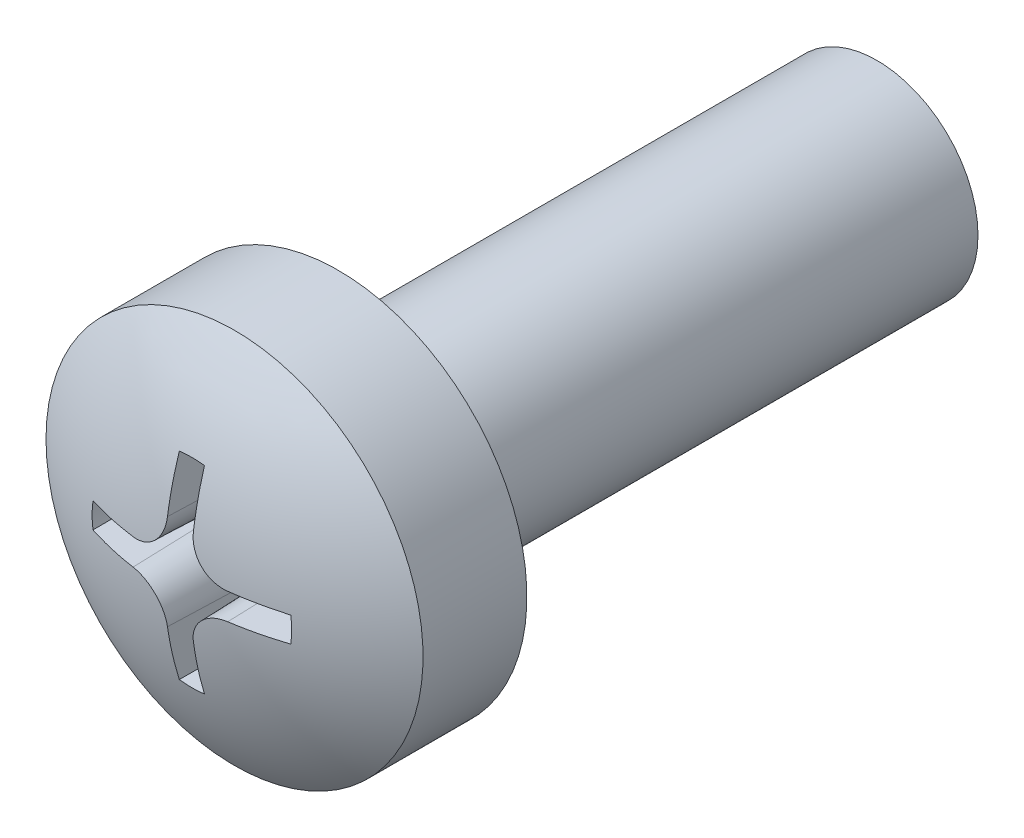
ISO-10303-21;
HEADER;
FILE_DESCRIPTION(('STEP AP214'),'2;1');
FILE_NAME('part.step','',(''),(''),'','','');
FILE_SCHEMA(('AUTOMOTIVE_DESIGN { 1 0 10303 214 1 1 1 1 }'));
ENDSEC;
DATA;
#1=APPLICATION_CONTEXT('core data for automotive mechanical design processes');
#2=APPLICATION_PROTOCOL_DEFINITION('international standard','automotive_design',2000,#1);
#3=PRODUCT_CONTEXT('',#1,'mechanical');
#4=PRODUCT('Part','Part','',(#3));
#5=PRODUCT_RELATED_PRODUCT_CATEGORY('part','',(#4));
#6=PRODUCT_DEFINITION_FORMATION('','',#4);
#7=PRODUCT_DEFINITION_CONTEXT('part definition',#1,'design');
#8=PRODUCT_DEFINITION('design','',#6,#7);
#9=PRODUCT_DEFINITION_SHAPE('','',#8);
#10=(LENGTH_UNIT() NAMED_UNIT(*) SI_UNIT(.MILLI.,.METRE.));
#11=(NAMED_UNIT(*) PLANE_ANGLE_UNIT() SI_UNIT($,.RADIAN.));
#12=(NAMED_UNIT(*) SI_UNIT($,.STERADIAN.) SOLID_ANGLE_UNIT());
#13=UNCERTAINTY_MEASURE_WITH_UNIT(LENGTH_MEASURE(1.E-05),#10,'distance_accuracy_value','');
#14=(GEOMETRIC_REPRESENTATION_CONTEXT(3) GLOBAL_UNCERTAINTY_ASSIGNED_CONTEXT((#13)) GLOBAL_UNIT_ASSIGNED_CONTEXT((#10,
#11,#12)) REPRESENTATION_CONTEXT('',''));
#15=CARTESIAN_POINT('',(0.,0.,0.));
#16=DIRECTION('',(0.,0.,1.));
#17=DIRECTION('',(1.,0.,0.));
#18=AXIS2_PLACEMENT_3D('',#15,#16,#17);
#19=CARTESIAN_POINT('',(0.,0.,8.));
#20=DIRECTION('',(0.,0.,-1.));
#21=DIRECTION('',(-1.,0.,0.));
#22=AXIS2_PLACEMENT_3D('',#19,#20,#21);
#23=CYLINDRICAL_SURFACE('',#22,1.5);
#24=CARTESIAN_POINT('',(0.,0.,8.));
#25=DIRECTION('',(0.,0.,1.));
#26=DIRECTION('',(1.,0.,0.));
#27=AXIS2_PLACEMENT_3D('',#24,#25,#26);
#28=CIRCLE('',#27,1.5);
#29=CARTESIAN_POINT('',(1.5,0.,8.));
#30=VERTEX_POINT('',#29);
#31=EDGE_CURVE('E211',#30,#30,#28,.T.);
#32=ORIENTED_EDGE('',*,*,#31,.F.);
#33=EDGE_LOOP('',(#32));
#34=FACE_BOUND('',#33,.T.);
#35=CARTESIAN_POINT('',(0.,0.,0.));
#36=DIRECTION('',(0.,0.,1.));
#37=DIRECTION('',(1.,0.,0.));
#38=AXIS2_PLACEMENT_3D('',#35,#36,#37);
#39=CIRCLE('',#38,1.5);
#40=CARTESIAN_POINT('',(1.5,0.,0.));
#41=VERTEX_POINT('',#40);
#42=EDGE_CURVE('E210',#41,#41,#39,.T.);
#43=ORIENTED_EDGE('',*,*,#42,.T.);
#44=EDGE_LOOP('',(#43));
#45=FACE_BOUND('',#44,.T.);
#46=ADVANCED_FACE('F39',(#34,#45),#23,.T.);
#47=CARTESIAN_POINT('',(0.,0.,0.));
#48=DIRECTION('',(0.,0.,1.));
#49=DIRECTION('',(1.,0.,0.));
#50=AXIS2_PLACEMENT_3D('',#47,#48,#49);
#51=PLANE('',#50);
#52=ORIENTED_EDGE('',*,*,#42,.F.);
#53=EDGE_LOOP('',(#52));
#54=FACE_BOUND('',#53,.T.);
#55=ADVANCED_FACE('F300',(#54),#51,.F.);
#56=CARTESIAN_POINT('',(0.,0.,8.));
#57=DIRECTION('',(0.,0.,-1.));
#58=DIRECTION('',(-1.,0.,0.));
#59=AXIS2_PLACEMENT_3D('',#56,#57,#58);
#60=PLANE('',#59);
#61=CARTESIAN_POINT('',(0.,0.,8.));
#62=DIRECTION('',(0.,0.,-1.));
#63=DIRECTION('',(-1.,0.,0.));
#64=AXIS2_PLACEMENT_3D('',#61,#62,#63);
#65=CIRCLE('',#64,2.79999990016222);
#66=CARTESIAN_POINT('',(-2.79999990016222,0.,8.));
#67=VERTEX_POINT('',#66);
#68=EDGE_CURVE('E207',#67,#67,#65,.T.);
#69=ORIENTED_EDGE('',*,*,#68,.T.);
#70=EDGE_LOOP('',(#69));
#71=FACE_BOUND('',#70,.T.);
#72=ORIENTED_EDGE('',*,*,#31,.T.);
#73=EDGE_LOOP('',(#72));
#74=FACE_BOUND('',#73,.T.);
#75=ADVANCED_FACE('F305',(#71,#74),#60,.T.);
#76=CARTESIAN_POINT('',(0.,0.,-0.393620134621003));
#77=DIRECTION('',(0.,0.,-1.));
#78=DIRECTION('',(-1.,0.,0.));
#79=AXIS2_PLACEMENT_3D('',#76,#77,#78);
#80=CYLINDRICAL_SURFACE('',#79,2.79999990016222);
#81=CARTESIAN_POINT('',(0.,0.,9.54246307978926));
#82=DIRECTION('',(0.,0.,-1.));
#83=DIRECTION('',(-1.,0.,0.));
#84=AXIS2_PLACEMENT_3D('',#81,#82,#83);
#85=CIRCLE('',#84,2.79999990016222);
#86=CARTESIAN_POINT('',(-2.79999990016222,0.,9.54246307978926));
#87=VERTEX_POINT('',#86);
#88=EDGE_CURVE('E155',#87,#87,#85,.T.);
#89=ORIENTED_EDGE('',*,*,#88,.T.);
#90=EDGE_LOOP('',(#89));
#91=FACE_BOUND('',#90,.T.);
#92=ORIENTED_EDGE('',*,*,#68,.F.);
#93=EDGE_LOOP('',(#92));
#94=FACE_BOUND('',#93,.T.);
#95=ADVANCED_FACE('F312',(#91,#94),#80,.T.);
#96=CARTESIAN_POINT('',(0.,0.,5.40000011175871));
#97=DIRECTION('',(0.,0.,-1.));
#98=DIRECTION('',(1.,0.,0.));
#99=AXIS2_PLACEMENT_3D('',#96,#97,#98);
#100=SPHERICAL_SURFACE('',#99,4.99999988824129);
#101=CARTESIAN_POINT('',(0.,0.,10.1754183821502));
#102=DIRECTION('',(0.,0.,-1.));
#103=DIRECTION('',(-1.,0.,0.));
#104=AXIS2_PLACEMENT_3D('',#101,#102,#103);
#105=CIRCLE('',#104,1.4816812157899);
#106=CARTESIAN_POINT('',(0.18668120666759,1.46987392394782,10.1754183821501));
#107=VERTEX_POINT('',#106);
#108=CARTESIAN_POINT('',(-0.186681206667593,1.46987392394782,10.1754183821501));
#109=VERTEX_POINT('',#108);
#110=EDGE_CURVE('E11',#107,#109,#105,.F.);
#111=ORIENTED_EDGE('',*,*,#110,.F.);
#112=CARTESIAN_POINT('',(0.0198956640512633,0.,5.39930533986049));
#113=DIRECTION('',(0.999390827019096,0.,-0.034899496702501));
#114=DIRECTION('',(-0.034899496702501,0.,-0.999390827019096));
#115=AXIS2_PLACEMENT_3D('',#112,#113,#114);
#116=CIRCLE('',#115,4.99996025606773);
#117=CARTESIAN_POINT('',(0.192632610704328,0.708178557647151,10.3458442955351));
#118=VERTEX_POINT('',#117);
#119=EDGE_CURVE('E46',#107,#118,#116,.T.);
#120=ORIENTED_EDGE('',*,*,#119,.T.);
#121=CARTESIAN_POINT('',(0.192631650862954,0.708378557647151,10.345815691475));
#122=CARTESIAN_POINT('',(0.192737639690806,0.679822741796073,10.3499041439734));
#123=CARTESIAN_POINT('',(0.195268867839181,0.651227392830896,10.3536463362414));
#124=CARTESIAN_POINT('',(0.205046889209158,0.59476703827459,10.3603460551712));
#125=CARTESIAN_POINT('',(0.212292618678018,0.566901869404939,10.3633037586285));
#126=CARTESIAN_POINT('',(0.231373694375068,0.51267267841366,10.3683466063254));
#127=CARTESIAN_POINT('',(0.24321326807329,0.486310064716558,10.3704309431667));
#128=CARTESIAN_POINT('',(0.271156607880554,0.435900324544809,10.3736603491012));
#129=CARTESIAN_POINT('',(0.287258672100205,0.411852279143786,10.3748057923215));
#130=CARTESIAN_POINT('',(0.323072075489885,0.367028886470806,10.3761158025717));
#131=CARTESIAN_POINT('',(0.342740648168188,0.346219679514825,10.3762912893596));
#132=CARTESIAN_POINT('',(0.385246757538768,0.30814670944778,10.3756853456951));
#133=CARTESIAN_POINT('',(0.408084792807392,0.290883505206881,10.3749037645383));
#134=CARTESIAN_POINT('',(0.456147210008961,0.260464262414973,10.3724133951705));
#135=CARTESIAN_POINT('',(0.481359759209805,0.247289131136679,10.3707090224733));
#136=CARTESIAN_POINT('',(0.533541444049374,0.225283958921734,10.3664258870809));
#137=CARTESIAN_POINT('',(0.560509920861877,0.216452298826715,10.3638474508254));
#138=CARTESIAN_POINT('',(0.606876295057338,0.205379627868596,10.3588207651558));
#139=CARTESIAN_POINT('',(0.626020977094074,0.201943221890059,10.3565812960749));
#140=CARTESIAN_POINT('',(0.66450204404321,0.197253494550336,10.3517582366185));
#141=CARTESIAN_POINT('',(0.683838077649067,0.195996727127303,10.349175196413));
#142=CARTESIAN_POINT('',(0.703167546290468,0.195835015722445,10.3464334662955));
#143=B_SPLINE_CURVE_WITH_KNOTS('',3,(#121,#122,#123,#124,#125,#126,#127,#128,#129,#130,#131,
#132,#133,#134,#135,#136,#137,#138,#139,#140,#141,#142),.UNSPECIFIED.,.F.,.F.,(4,2,2,2,2,2,2,2,
2,2,4),(0.,0.0864417829586744,0.172864068455127,0.259366073122684,0.345833591994609,
0.431325646912079,0.516831165542016,0.601931114274005,0.686999315371811,0.745618262708562,
0.804144447281415),.UNSPECIFIED.);
#144=CARTESIAN_POINT('',(0.702917362553185,0.19583721033533,10.3464689381926));
#145=VERTEX_POINT('',#144);
#146=EDGE_CURVE('E282',#118,#145,#143,.T.);
#147=ORIENTED_EDGE('',*,*,#146,.T.);
#148=CARTESIAN_POINT('',(0.00010539015335094,0.0259265633149154,5.39909472873738));
#149=DIRECTION('',(0.00406243901494415,0.999382570249833,-0.034899496702501));
#150=DIRECTION('',(0.,0.0348997846864301,0.999390816962434));
#151=AXIS2_PLACEMENT_3D('',#148,#149,#150);
#152=CIRCLE('',#151,4.99993258603575);
#153=CARTESIAN_POINT('',(1.46986565043204,0.186746338396853,10.1754183821502));
#154=VERTEX_POINT('',#153);
#155=EDGE_CURVE('E280',#154,#145,#152,.F.);
#156=ORIENTED_EDGE('',*,*,#155,.F.);
#157=CARTESIAN_POINT('',(0.,0.,10.1754183821502));
#158=DIRECTION('',(0.,0.,-1.));
#159=DIRECTION('',(-1.,0.,0.));
#160=AXIS2_PLACEMENT_3D('',#157,#158,#159);
#161=CIRCLE('',#160,1.4816812157899);
#162=CARTESIAN_POINT('',(1.46986565043204,-0.186746338396852,10.1754183821501));
#163=VERTEX_POINT('',#162);
#164=EDGE_CURVE('E278',#163,#154,#161,.F.);
#165=ORIENTED_EDGE('',*,*,#164,.F.);
#166=CARTESIAN_POINT('',(0.000105390153350971,-0.0259265633149169,5.39909472873738));
#167=DIRECTION('',(0.00406243901494512,-0.999382570249833,-0.034899496702501));
#168=DIRECTION('',(0.,0.0348997846864301,-0.999390816962434));
#169=AXIS2_PLACEMENT_3D('',#166,#167,#168);
#170=CIRCLE('',#169,4.99993258603575);
#171=CARTESIAN_POINT('',(0.702917362553185,-0.195837210335331,10.3464689381926));
#172=VERTEX_POINT('',#171);
#173=EDGE_CURVE('E275',#163,#172,#170,.T.);
#174=ORIENTED_EDGE('',*,*,#173,.T.);
#175=CARTESIAN_POINT('',(0.192631650862954,-0.708378557647152,10.345815691475));
#176=CARTESIAN_POINT('',(0.192737639690806,-0.679822741796074,10.3499041439734));
#177=CARTESIAN_POINT('',(0.195268867839181,-0.651227392830896,10.3536463362414));
#178=CARTESIAN_POINT('',(0.205046889209158,-0.59476703827459,10.3603460551712));
#179=CARTESIAN_POINT('',(0.212292618678018,-0.56690186940494,10.3633037586285));
#180=CARTESIAN_POINT('',(0.231373694375068,-0.512672678413661,10.3683466063254));
#181=CARTESIAN_POINT('',(0.24321326807329,-0.486310064716559,10.3704309431667));
#182=CARTESIAN_POINT('',(0.271156607880554,-0.435900324544809,10.3736603491012));
#183=CARTESIAN_POINT('',(0.287258672100205,-0.411852279143786,10.3748057923215));
#184=CARTESIAN_POINT('',(0.323072075489885,-0.367028886470807,10.3761158025717));
#185=CARTESIAN_POINT('',(0.342740648168188,-0.346219679514826,10.3762912893596));
#186=CARTESIAN_POINT('',(0.385246757538768,-0.308146709447781,10.3756853456951));
#187=CARTESIAN_POINT('',(0.408084792807392,-0.290883505206882,10.3749037645383));
#188=CARTESIAN_POINT('',(0.456147210008961,-0.260464262414974,10.3724133951705));
#189=CARTESIAN_POINT('',(0.481359759209805,-0.247289131136679,10.3707090224733));
#190=CARTESIAN_POINT('',(0.533541444049374,-0.225283958921735,10.3664258870809));
#191=CARTESIAN_POINT('',(0.560509920861878,-0.216452298826716,10.3638474508254));
#192=CARTESIAN_POINT('',(0.606876295057338,-0.205379627868597,10.3588207651558));
#193=CARTESIAN_POINT('',(0.626020977094074,-0.201943221890059,10.3565812960749));
#194=CARTESIAN_POINT('',(0.66450204404321,-0.197253494550336,10.3517582366185));
#195=CARTESIAN_POINT('',(0.683838077649067,-0.195996727127304,10.349175196413));
#196=CARTESIAN_POINT('',(0.703167546290467,-0.195835015722445,10.3464334662955));
#197=B_SPLINE_CURVE_WITH_KNOTS('',3,(#175,#176,#177,#178,#179,#180,#181,#182,#183,#184,#185,
#186,#187,#188,#189,#190,#191,#192,#193,#194,#195,#196),.UNSPECIFIED.,.F.,.F.,(4,2,2,2,2,2,2,2,
2,2,4),(0.,0.0864417829586745,0.172864068455127,0.259366073122684,0.345833591994609,
0.431325646912079,0.516831165542017,0.601931114274005,0.686999315371811,0.745618262708562,
0.804144447281414),.UNSPECIFIED.);
#198=CARTESIAN_POINT('',(0.192632610704328,-0.708178557647152,10.3458442955351));
#199=VERTEX_POINT('',#198);
#200=EDGE_CURVE('E269',#199,#172,#197,.T.);
#201=ORIENTED_EDGE('',*,*,#200,.F.);
#202=CARTESIAN_POINT('',(0.0198956640512633,0.,5.39930533986049));
#203=DIRECTION('',(0.999390827019096,0.,-0.034899496702501));
#204=DIRECTION('',(-0.034899496702501,0.,-0.999390827019096));
#205=AXIS2_PLACEMENT_3D('',#202,#203,#204);
#206=CIRCLE('',#205,4.99996025606773);
#207=CARTESIAN_POINT('',(0.186681206667591,-1.46987392394782,10.1754183821502));
#208=VERTEX_POINT('',#207);
#209=EDGE_CURVE('E267',#208,#199,#206,.F.);
#210=ORIENTED_EDGE('',*,*,#209,.F.);
#211=CARTESIAN_POINT('',(0.,0.,10.1754183821502));
#212=DIRECTION('',(0.,0.,-1.));
#213=DIRECTION('',(-1.,0.,0.));
#214=AXIS2_PLACEMENT_3D('',#211,#212,#213);
#215=CIRCLE('',#214,1.4816812157899);
#216=CARTESIAN_POINT('',(-0.186681206667593,-1.46987392394782,10.1754183821501));
#217=VERTEX_POINT('',#216);
#218=EDGE_CURVE('E264',#208,#217,#215,.T.);
#219=ORIENTED_EDGE('',*,*,#218,.T.);
#220=CARTESIAN_POINT('',(-0.0198956640512654,0.,5.39930533986049));
#221=DIRECTION('',(-0.999390827019096,0.,-0.034899496702501));
#222=DIRECTION('',(-0.034899496702501,0.,0.999390827019096));
#223=AXIS2_PLACEMENT_3D('',#220,#221,#222);
#224=CIRCLE('',#223,4.99996025606773);
#225=CARTESIAN_POINT('',(-0.19263261070433,-0.708178557647151,10.3458442955351));
#226=VERTEX_POINT('',#225);
#227=EDGE_CURVE('E260',#217,#226,#224,.T.);
#228=ORIENTED_EDGE('',*,*,#227,.T.);
#229=CARTESIAN_POINT('',(-0.70316754629047,-0.195835015722445,10.3464334662955));
#230=CARTESIAN_POINT('',(-0.674619447950853,-0.196052963217916,10.3504857241648));
#231=CARTESIAN_POINT('',(-0.64604143463723,-0.198695168407334,10.3541890416191));
#232=CARTESIAN_POINT('',(-0.589634494727846,-0.208689654905481,10.3608068014756));
#233=CARTESIAN_POINT('',(-0.561805393198953,-0.216040826152062,10.3637214295682));
#234=CARTESIAN_POINT('',(-0.50766612082123,-0.235323893103952,10.3686750861046));
#235=CARTESIAN_POINT('',(-0.481357369172765,-0.247259991703852,10.370713307523));
#236=CARTESIAN_POINT('',(-0.431071022991569,-0.275383990623327,10.3738489099634));
#237=CARTESIAN_POINT('',(-0.407092510169895,-0.291570206692358,10.3749466629444));
#238=CARTESIAN_POINT('',(-0.362416703115867,-0.327538701485094,10.3761618083202));
#239=CARTESIAN_POINT('',(-0.34168588735275,-0.347278991317759,10.376289966384));
#240=CARTESIAN_POINT('',(-0.303780328011577,-0.389912448398922,10.375590364716));
#241=CARTESIAN_POINT('',(-0.286606147147997,-0.412806113607388,10.3747624538554));
#242=CARTESIAN_POINT('',(-0.25636685808405,-0.460969475916929,10.3721816258056));
#243=CARTESIAN_POINT('',(-0.243283863198687,-0.486228184526672,10.3704328274806));
#244=CARTESIAN_POINT('',(-0.22146899790456,-0.538485231439468,10.366063898297));
#245=CARTESIAN_POINT('',(-0.212735526227358,-0.565482925398504,10.3634440886927));
#246=CARTESIAN_POINT('',(-0.201823996880683,-0.61191361527353,10.3583478129874));
#247=CARTESIAN_POINT('',(-0.198453223120025,-0.631098599357625,10.3560784464194));
#248=CARTESIAN_POINT('',(-0.193901764340931,-0.669652448873598,10.3511968730386));
#249=CARTESIAN_POINT('',(-0.192717622166763,-0.689020975292663,10.3485852144187));
#250=CARTESIAN_POINT('',(-0.192631650862956,-0.708378557647151,10.345815691475));
#251=B_SPLINE_CURVE_WITH_KNOTS('',3,(#229,#230,#231,#232,#233,#234,#235,#236,#237,#238,#239,
#240,#241,#242,#243,#244,#245,#246,#247,#248,#249,#250),.UNSPECIFIED.,.F.,.F.,(4,2,2,2,2,2,2,2,
2,2,4),(0.,0.086405343611419,0.172790326060609,0.259254685287909,0.34568483171133,
0.431153892876567,0.51663646625136,0.601739908197796,0.686811996276178,0.745524819849982,
0.804144736260156),.UNSPECIFIED.);
#252=CARTESIAN_POINT('',(-0.702917362553187,-0.195837210335331,10.3464689381926));
#253=VERTEX_POINT('',#252);
#254=EDGE_CURVE('E253',#253,#226,#251,.T.);
#255=ORIENTED_EDGE('',*,*,#254,.F.);
#256=CARTESIAN_POINT('',(-0.000105390153349066,-0.0259265633149168,5.39909472873738));
#257=DIRECTION('',(-0.0040624390149453,-0.999382570249833,-0.034899496702501));
#258=DIRECTION('',(0.,0.0348997846864301,-0.999390816962434));
#259=AXIS2_PLACEMENT_3D('',#256,#257,#258);
#260=CIRCLE('',#259,4.99993258603575);
#261=CARTESIAN_POINT('',(-1.46986565043204,-0.186746338396853,10.1754183821502));
#262=VERTEX_POINT('',#261);
#263=EDGE_CURVE('E261',#262,#253,#260,.F.);
#264=ORIENTED_EDGE('',*,*,#263,.F.);
#265=CARTESIAN_POINT('',(0.,0.,10.1754183821502));
#266=DIRECTION('',(0.,0.,-1.));
#267=DIRECTION('',(-1.,0.,0.));
#268=AXIS2_PLACEMENT_3D('',#265,#266,#267);
#269=CIRCLE('',#268,1.4816812157899);
#270=CARTESIAN_POINT('',(-1.46986565043204,0.186746338396852,10.1754183821501));
#271=VERTEX_POINT('',#270);
#272=EDGE_CURVE('E523',#262,#271,#269,.T.);
#273=ORIENTED_EDGE('',*,*,#272,.T.);
#274=CARTESIAN_POINT('',(-0.000105390153349066,0.0259265633149168,5.39909472873738));
#275=DIRECTION('',(-0.00406243901494529,0.999382570249833,-0.034899496702501));
#276=DIRECTION('',(0.,0.0348997846864301,0.999390816962434));
#277=AXIS2_PLACEMENT_3D('',#274,#275,#276);
#278=CIRCLE('',#277,4.99993258603575);
#279=CARTESIAN_POINT('',(-0.702917362553187,0.195837210335331,10.3464689381926));
#280=VERTEX_POINT('',#279);
#281=EDGE_CURVE('E226',#271,#280,#278,.T.);
#282=ORIENTED_EDGE('',*,*,#281,.T.);
#283=CARTESIAN_POINT('',(-0.192631650862955,0.708378557647151,10.345815691475));
#284=CARTESIAN_POINT('',(-0.192737639690808,0.679822741796074,10.3499041439734));
#285=CARTESIAN_POINT('',(-0.195268867839183,0.651227392830896,10.3536463362414));
#286=CARTESIAN_POINT('',(-0.20504688920916,0.59476703827459,10.3603460551712));
#287=CARTESIAN_POINT('',(-0.21229261867802,0.566901869404939,10.3633037586285));
#288=CARTESIAN_POINT('',(-0.231373694375069,0.51267267841366,10.3683466063254));
#289=CARTESIAN_POINT('',(-0.243213268073292,0.486310064716559,10.3704309431667));
#290=CARTESIAN_POINT('',(-0.271156607880555,0.435900324544809,10.3736603491012));
#291=CARTESIAN_POINT('',(-0.287258672100206,0.411852279143786,10.3748057923215));
#292=CARTESIAN_POINT('',(-0.323072075489887,0.367028886470806,10.3761158025717));
#293=CARTESIAN_POINT('',(-0.34274064816819,0.346219679514826,10.3762912893596));
#294=CARTESIAN_POINT('',(-0.38524675753877,0.30814670944778,10.3756853456951));
#295=CARTESIAN_POINT('',(-0.408084792807394,0.290883505206882,10.3749037645383));
#296=CARTESIAN_POINT('',(-0.456147210008963,0.260464262414974,10.3724133951705));
#297=CARTESIAN_POINT('',(-0.481359759209807,0.247289131136679,10.3707090224733));
#298=CARTESIAN_POINT('',(-0.533541444049376,0.225283958921735,10.3664258870809));
#299=CARTESIAN_POINT('',(-0.560509920861879,0.216452298826716,10.3638474508254));
#300=CARTESIAN_POINT('',(-0.60687629505734,0.205379627868597,10.3588207651558));
#301=CARTESIAN_POINT('',(-0.626020977094076,0.201943221890059,10.3565812960749));
#302=CARTESIAN_POINT('',(-0.664502044043212,0.197253494550336,10.3517582366185));
#303=CARTESIAN_POINT('',(-0.683838077649068,0.195996727127304,10.349175196413));
#304=CARTESIAN_POINT('',(-0.703167546290469,0.195835015722445,10.3464334662955));
#305=B_SPLINE_CURVE_WITH_KNOTS('',3,(#283,#284,#285,#286,#287,#288,#289,#290,#291,#292,#293,
#294,#295,#296,#297,#298,#299,#300,#301,#302,#303,#304),.UNSPECIFIED.,.F.,.F.,(4,2,2,2,2,2,2,2,
2,2,4),(0.,0.0864417829586746,0.172864068455127,0.259366073122684,0.345833591994609,
0.431325646912079,0.516831165542016,0.601931114274005,0.686999315371811,0.745618262708561,
0.804144447281414),.UNSPECIFIED.);
#306=CARTESIAN_POINT('',(-0.19263261070433,0.708178557647151,10.3458442955351));
#307=VERTEX_POINT('',#306);
#308=EDGE_CURVE('E218',#307,#280,#305,.T.);
#309=ORIENTED_EDGE('',*,*,#308,.F.);
#310=CARTESIAN_POINT('',(-0.0198956640512644,0.,5.39930533986049));
#311=DIRECTION('',(-0.999390827019096,0.,-0.034899496702501));
#312=DIRECTION('',(-0.034899496702501,0.,0.999390827019096));
#313=AXIS2_PLACEMENT_3D('',#310,#311,#312);
#314=CIRCLE('',#313,4.99996025606773);
#315=EDGE_CURVE('E214',#109,#307,#314,.F.);
#316=ORIENTED_EDGE('',*,*,#315,.F.);
#317=EDGE_LOOP('',(#111,#120,#147,#156,#165,#174,#201,#210,#219,#228,#255,#264,#273,#282,#309,#316));
#318=FACE_BOUND('',#317,.T.);
#319=ORIENTED_EDGE('',*,*,#88,.F.);
#320=EDGE_LOOP('',(#319));
#321=FACE_BOUND('',#320,.T.);
#322=ADVANCED_FACE('F228',(#318,#321),#100,.T.);
#323=CARTESIAN_POINT('',(0.,0.,10.7000001));
#324=DIRECTION('',(0.,0.,1.));
#325=DIRECTION('',(1.,0.,0.));
#326=AXIS2_PLACEMENT_3D('',#323,#324,#325);
#327=CONICAL_SURFACE('',#326,1.50000001303852,0.0349065850398867);
#328=ORIENTED_EDGE('',*,*,#110,.T.);
#329=CARTESIAN_POINT('',(-0.142142619910814,1.43009594495933,8.90000013091991));
#330=CARTESIAN_POINT('',(-0.152618658076336,1.43957885994155,9.19999461322929));
#331=CARTESIAN_POINT('',(-0.163094792502732,1.4489727928664,9.49999185208944));
#332=CARTESIAN_POINT('',(-0.184047253837866,1.46758269456637,10.0999918417828));
#333=CARTESIAN_POINT('',(-0.194523580746602,1.47679866334215,10.399994592616));
#334=CARTESIAN_POINT('',(-0.205000003916213,1.48592565006124,10.7000001));
#335=B_SPLINE_CURVE_WITH_KNOTS('',3,(#329,#330,#331,#332,#333,#334),.UNSPECIFIED.,.F.,.F.,(4,2,
4),(0.,0.900981158642231,1.80196231389533),.UNSPECIFIED.);
#336=CARTESIAN_POINT('',(-0.142142619910814,1.43009594495933,8.90000013091991));
#337=VERTEX_POINT('',#336);
#338=EDGE_CURVE('E53',#337,#109,#335,.T.);
#339=ORIENTED_EDGE('',*,*,#338,.F.);
#340=CARTESIAN_POINT('',(0.,0.,8.90000013091991));
#341=DIRECTION('',(0.,0.,1.));
#342=DIRECTION('',(1.,0.,0.));
#343=AXIS2_PLACEMENT_3D('',#340,#341,#342);
#344=CIRCLE('',#343,1.43714262903312);
#345=CARTESIAN_POINT('',(0.142142619910811,1.43009594495933,8.90000013091991));
#346=VERTEX_POINT('',#345);
#347=EDGE_CURVE('E163',#346,#337,#344,.T.);
#348=ORIENTED_EDGE('',*,*,#347,.F.);
#349=CARTESIAN_POINT('',(0.142142619910811,1.43009594495933,8.90000013091991));
#350=CARTESIAN_POINT('',(0.152618658076333,1.43957885994155,9.19999461322929));
#351=CARTESIAN_POINT('',(0.16309479250273,1.4489727928664,9.49999185208944));
#352=CARTESIAN_POINT('',(0.184047253837863,1.46758269456637,10.0999918417828));
#353=CARTESIAN_POINT('',(0.1945235807466,1.47679866334215,10.399994592616));
#354=CARTESIAN_POINT('',(0.205000003916211,1.48592565006124,10.7000001));
#355=B_SPLINE_CURVE_WITH_KNOTS('',3,(#349,#350,#351,#352,#353,#354),.UNSPECIFIED.,.F.,.F.,(4,2,
4),(0.,0.900981158642231,1.80196231389533),.UNSPECIFIED.);
#356=EDGE_CURVE('E147',#346,#107,#355,.T.);
#357=ORIENTED_EDGE('',*,*,#356,.T.);
#358=EDGE_LOOP('',(#328,#339,#348,#357));
#359=FACE_BOUND('',#358,.T.);
#360=ADVANCED_FACE('F167',(#359),#327,.F.);
#361=CARTESIAN_POINT('',(0.205000003916211,1.48592565006124,10.7000001));
#362=DIRECTION('',(0.999390827019096,0.,-0.034899496702501));
#363=DIRECTION('',(-0.034899496702501,0.,-0.999390827019096));
#364=AXIS2_PLACEMENT_3D('',#361,#362,#363);
#365=PLANE('',#364);
#366=ORIENTED_EDGE('',*,*,#356,.F.);
#367=DIRECTION('',(0.,1.,0.));
#368=VECTOR('',#367,1.);
#369=CARTESIAN_POINT('',(0.142142619910812,0.,8.90000013091991));
#370=LINE('',#369,#368);
#371=CARTESIAN_POINT('',(0.142142619910811,0.708178557647151,8.90000013091991));
#372=VERTEX_POINT('',#371);
#373=EDGE_CURVE('E150',#346,#372,#370,.F.);
#374=ORIENTED_EDGE('',*,*,#373,.T.);
#375=DIRECTION('',(0.034899496702501,0.,0.999390827019096));
#376=VECTOR('',#375,1.);
#377=CARTESIAN_POINT('',(0.20500000391621,0.708178557647151,10.7000001));
#378=LINE('',#377,#376);
#379=EDGE_CURVE('E156',#372,#118,#378,.T.);
#380=ORIENTED_EDGE('',*,*,#379,.T.);
#381=ORIENTED_EDGE('',*,*,#119,.F.);
#382=EDGE_LOOP('',(#366,#374,#380,#381));
#383=FACE_BOUND('',#382,.T.);
#384=ADVANCED_FACE('F149',(#383),#365,.F.);
#385=CARTESIAN_POINT('',(0.705000003916211,0.708178557647151,10.7000001));
#386=DIRECTION('',(0.,0.,-1.));
#387=DIRECTION('',(1.,0.,0.));
#388=AXIS2_PLACEMENT_3D('',#385,#386,#387);
#389=CONICAL_SURFACE('',#388,0.5,0.0349065850398867);
#390=ORIENTED_EDGE('',*,*,#379,.F.);
#391=CARTESIAN_POINT('',(0.705000003916211,0.708178557647151,8.90000013091991));
#392=DIRECTION('',(0.,0.,1.));
#393=DIRECTION('',(1.,0.,0.));
#394=AXIS2_PLACEMENT_3D('',#391,#392,#393);
#395=CIRCLE('',#394,0.562857384005399);
#396=CARTESIAN_POINT('',(0.702712036351556,0.145325823858085,8.90000013091991));
#397=VERTEX_POINT('',#396);
#398=EDGE_CURVE('E165',#372,#397,#395,.T.);
#399=ORIENTED_EDGE('',*,*,#398,.T.);
#400=DIRECTION('',(0.000141863496415148,0.0348992083697649,0.999390827019096));
#401=VECTOR('',#400,1.);
#402=CARTESIAN_POINT('',(0.702967546290468,0.208182688548215,10.7000001));
#403=LINE('',#402,#401);
#404=EDGE_CURVE('E425',#397,#145,#403,.T.);
#405=ORIENTED_EDGE('',*,*,#404,.T.);
#406=ORIENTED_EDGE('',*,*,#146,.F.);
#407=EDGE_LOOP('',(#390,#399,#405,#406));
#408=FACE_BOUND('',#407,.T.);
#409=ADVANCED_FACE('F288',(#408),#389,.T.);
#410=CARTESIAN_POINT('',(1.48592565006123,0.205000003916213,10.7000001));
#411=DIRECTION('',(0.00406243901494415,0.999382570249833,-0.034899496702501));
#412=DIRECTION('',(0.,0.0348997846864301,0.999390816962434));
#413=AXIS2_PLACEMENT_3D('',#410,#411,#412);
#414=PLANE('',#413);
#415=ORIENTED_EDGE('',*,*,#155,.T.);
#416=ORIENTED_EDGE('',*,*,#404,.F.);
#417=DIRECTION('',(-0.99999173819787,0.00406491525148502,0.));
#418=VECTOR('',#417,1.);
#419=CARTESIAN_POINT('',(0.000602343564913371,0.148179863836023,8.90000013091991));
#420=LINE('',#419,#418);
#421=CARTESIAN_POINT('',(1.43007341244828,0.142369137079488,8.90000013091991));
#422=VERTEX_POINT('',#421);
#423=EDGE_CURVE('E176',#422,#397,#420,.T.);
#424=ORIENTED_EDGE('',*,*,#423,.F.);
#425=CARTESIAN_POINT('',(1.43007341244828,0.142369137079488,8.90000013091991));
#426=CARTESIAN_POINT('',(1.43955869120937,0.152806706922151,9.19999467904414));
#427=CARTESIAN_POINT('',(1.44895568373278,0.163244730756208,9.49999195080733));
#428=CARTESIAN_POINT('',(1.46757309626977,0.184121686368453,10.0999919405007));
#429=CARTESIAN_POINT('',(1.47679351628402,0.194560618146638,10.3999946584309));
#430=CARTESIAN_POINT('',(1.48592565006123,0.205000003916213,10.7000001));
#431=B_SPLINE_CURVE_WITH_KNOTS('',3,(#425,#426,#427,#428,#429,#430),.UNSPECIFIED.,.F.,.F.,(4,2,
4),(0.,0.900977563471273,1.80195512360615),.UNSPECIFIED.);
#432=EDGE_CURVE('E419',#422,#154,#431,.T.);
#433=ORIENTED_EDGE('',*,*,#432,.T.);
#434=EDGE_LOOP('',(#415,#416,#424,#433));
#435=FACE_BOUND('',#434,.T.);
#436=ADVANCED_FACE('F240',(#435),#414,.F.);
#437=CARTESIAN_POINT('',(0.,0.,10.7000001));
#438=DIRECTION('',(0.,0.,1.));
#439=DIRECTION('',(1.,0.,0.));
#440=AXIS2_PLACEMENT_3D('',#437,#438,#439);
#441=CONICAL_SURFACE('',#440,1.50000001303852,0.0349065850398867);
#442=ORIENTED_EDGE('',*,*,#164,.T.);
#443=ORIENTED_EDGE('',*,*,#432,.F.);
#444=CARTESIAN_POINT('',(0.,0.,8.90000013091991));
#445=DIRECTION('',(0.,0.,1.));
#446=DIRECTION('',(1.,0.,0.));
#447=AXIS2_PLACEMENT_3D('',#444,#445,#446);
#448=CIRCLE('',#447,1.43714262903312);
#449=CARTESIAN_POINT('',(1.43007341244828,-0.142369137079488,8.90000013091991));
#450=VERTEX_POINT('',#449);
#451=EDGE_CURVE('E178',#450,#422,#448,.T.);
#452=ORIENTED_EDGE('',*,*,#451,.F.);
#453=CARTESIAN_POINT('',(1.43007341244828,-0.142369137079488,8.90000013091991));
#454=CARTESIAN_POINT('',(1.43955869120937,-0.152806706922151,9.19999467904414));
#455=CARTESIAN_POINT('',(1.44895568373278,-0.163244730756208,9.49999195080733));
#456=CARTESIAN_POINT('',(1.46757309626977,-0.184121686368453,10.0999919405007));
#457=CARTESIAN_POINT('',(1.47679351628402,-0.194560618146638,10.3999946584309));
#458=CARTESIAN_POINT('',(1.48592565006123,-0.205000003916213,10.7000001));
#459=B_SPLINE_CURVE_WITH_KNOTS('',3,(#453,#454,#455,#456,#457,#458),.UNSPECIFIED.,.F.,.F.,(4,2,
4),(0.,0.900977563471273,1.80195512360615),.UNSPECIFIED.);
#460=EDGE_CURVE('E413',#450,#163,#459,.T.);
#461=ORIENTED_EDGE('',*,*,#460,.T.);
#462=EDGE_LOOP('',(#442,#443,#452,#461));
#463=FACE_BOUND('',#462,.T.);
#464=ADVANCED_FACE('F296',(#463),#441,.F.);
#465=CARTESIAN_POINT('',(1.48592565006123,-0.205000003916213,10.7000001));
#466=DIRECTION('',(0.00406243901494512,-0.999382570249833,-0.034899496702501));
#467=DIRECTION('',(0.,0.0348997846864301,-0.999390816962434));
#468=AXIS2_PLACEMENT_3D('',#465,#466,#467);
#469=PLANE('',#468);
#470=ORIENTED_EDGE('',*,*,#460,.F.);
#471=DIRECTION('',(0.99999173819787,0.00406491525148599,0.));
#472=VECTOR('',#471,1.);
#473=CARTESIAN_POINT('',(0.00060234356491352,-0.148179863836024,8.90000013091991));
#474=LINE('',#473,#472);
#475=CARTESIAN_POINT('',(0.702712036351556,-0.145325823858086,8.90000013091991));
#476=VERTEX_POINT('',#475);
#477=EDGE_CURVE('E181',#450,#476,#474,.F.);
#478=ORIENTED_EDGE('',*,*,#477,.T.);
#479=DIRECTION('',(0.000141863496415188,-0.0348992083697649,0.999390827019096));
#480=VECTOR('',#479,1.);
#481=CARTESIAN_POINT('',(0.702967546290468,-0.208182688548216,10.7000001));
#482=LINE('',#481,#480);
#483=EDGE_CURVE('E435',#476,#172,#482,.T.);
#484=ORIENTED_EDGE('',*,*,#483,.T.);
#485=ORIENTED_EDGE('',*,*,#173,.F.);
#486=EDGE_LOOP('',(#470,#478,#484,#485));
#487=FACE_BOUND('',#486,.T.);
#488=ADVANCED_FACE('F408',(#487),#469,.F.);
#489=CARTESIAN_POINT('',(0.705000003916211,-0.708178557647152,10.7000001));
#490=DIRECTION('',(0.,0.,-1.));
#491=DIRECTION('',(-1.,0.,0.));
#492=AXIS2_PLACEMENT_3D('',#489,#490,#491);
#493=CONICAL_SURFACE('',#492,0.5,0.0349065850398867);
#494=ORIENTED_EDGE('',*,*,#200,.T.);
#495=ORIENTED_EDGE('',*,*,#483,.F.);
#496=CARTESIAN_POINT('',(0.705000003916211,-0.708178557647152,8.90000013091991));
#497=DIRECTION('',(0.,0.,1.));
#498=DIRECTION('',(1.,0.,0.));
#499=AXIS2_PLACEMENT_3D('',#496,#497,#498);
#500=CIRCLE('',#499,0.562857384005399);
#501=CARTESIAN_POINT('',(0.142142619910812,-0.708178557647152,8.90000013091991));
#502=VERTEX_POINT('',#501);
#503=EDGE_CURVE('E183',#502,#476,#500,.F.);
#504=ORIENTED_EDGE('',*,*,#503,.F.);
#505=DIRECTION('',(0.034899496702501,0.,0.999390827019096));
#506=VECTOR('',#505,1.);
#507=CARTESIAN_POINT('',(0.205000003916211,-0.708178557647152,10.7000001));
#508=LINE('',#507,#506);
#509=EDGE_CURVE('E399',#502,#199,#508,.T.);
#510=ORIENTED_EDGE('',*,*,#509,.T.);
#511=EDGE_LOOP('',(#494,#495,#504,#510));
#512=FACE_BOUND('',#511,.T.);
#513=ADVANCED_FACE('F250',(#512),#493,.T.);
#514=CARTESIAN_POINT('',(0.205000003916211,-1.48592565006124,10.7000001));
#515=DIRECTION('',(0.999390827019096,0.,-0.034899496702501));
#516=DIRECTION('',(-0.034899496702501,0.,-0.999390827019096));
#517=AXIS2_PLACEMENT_3D('',#514,#515,#516);
#518=PLANE('',#517);
#519=ORIENTED_EDGE('',*,*,#209,.T.);
#520=ORIENTED_EDGE('',*,*,#509,.F.);
#521=DIRECTION('',(0.,1.,0.));
#522=VECTOR('',#521,1.);
#523=CARTESIAN_POINT('',(0.142142619910812,0.,8.90000013091991));
#524=LINE('',#523,#522);
#525=CARTESIAN_POINT('',(0.142142619910811,-1.43009594495933,8.90000013091991));
#526=VERTEX_POINT('',#525);
#527=EDGE_CURVE('E186',#526,#502,#524,.T.);
#528=ORIENTED_EDGE('',*,*,#527,.F.);
#529=CARTESIAN_POINT('',(0.142142619910811,-1.43009594495933,8.90000013091991));
#530=CARTESIAN_POINT('',(0.152618658076333,-1.43957885994155,9.19999461322929));
#531=CARTESIAN_POINT('',(0.16309479250273,-1.4489727928664,9.49999185208944));
#532=CARTESIAN_POINT('',(0.184047253837863,-1.46758269456637,10.0999918417828));
#533=CARTESIAN_POINT('',(0.1945235807466,-1.47679866334215,10.399994592616));
#534=CARTESIAN_POINT('',(0.205000003916211,-1.48592565006124,10.7000001));
#535=B_SPLINE_CURVE_WITH_KNOTS('',3,(#529,#530,#531,#532,#533,#534),.UNSPECIFIED.,.F.,.F.,(4,2,
4),(0.,0.900981158642231,1.80196231389533),.UNSPECIFIED.);
#536=EDGE_CURVE('E391',#526,#208,#535,.T.);
#537=ORIENTED_EDGE('',*,*,#536,.T.);
#538=EDGE_LOOP('',(#519,#520,#528,#537));
#539=FACE_BOUND('',#538,.T.);
#540=ADVANCED_FACE('F401',(#539),#518,.F.);
#541=CARTESIAN_POINT('',(0.,0.,10.7000001));
#542=DIRECTION('',(0.,0.,1.));
#543=DIRECTION('',(-1.,0.,0.));
#544=AXIS2_PLACEMENT_3D('',#541,#542,#543);
#545=CONICAL_SURFACE('',#544,1.50000001303852,0.0349065850398867);
#546=ORIENTED_EDGE('',*,*,#536,.F.);
#547=CARTESIAN_POINT('',(0.,0.,8.90000013091991));
#548=DIRECTION('',(0.,0.,1.));
#549=DIRECTION('',(1.,0.,0.));
#550=AXIS2_PLACEMENT_3D('',#547,#548,#549);
#551=CIRCLE('',#550,1.43714262903312);
#552=CARTESIAN_POINT('',(-0.142142619910814,-1.43009594495933,8.90000013091991));
#553=VERTEX_POINT('',#552);
#554=EDGE_CURVE('E189',#526,#553,#551,.F.);
#555=ORIENTED_EDGE('',*,*,#554,.T.);
#556=CARTESIAN_POINT('',(-0.142142619910814,-1.43009594495933,8.90000013091991));
#557=CARTESIAN_POINT('',(-0.152618658076336,-1.43957885994155,9.19999461322929));
#558=CARTESIAN_POINT('',(-0.163094792502732,-1.4489727928664,9.49999185208944));
#559=CARTESIAN_POINT('',(-0.184047253837866,-1.46758269456637,10.0999918417828));
#560=CARTESIAN_POINT('',(-0.194523580746602,-1.47679866334215,10.399994592616));
#561=CARTESIAN_POINT('',(-0.205000003916213,-1.48592565006124,10.7000001));
#562=B_SPLINE_CURVE_WITH_KNOTS('',3,(#556,#557,#558,#559,#560,#561),.UNSPECIFIED.,.F.,.F.,(4,2,
4),(0.,0.900981158642231,1.80196231389533),.UNSPECIFIED.);
#563=EDGE_CURVE('E383',#553,#217,#562,.T.);
#564=ORIENTED_EDGE('',*,*,#563,.T.);
#565=ORIENTED_EDGE('',*,*,#218,.F.);
#566=EDGE_LOOP('',(#546,#555,#564,#565));
#567=FACE_BOUND('',#566,.T.);
#568=ADVANCED_FACE('F378',(#567),#545,.F.);
#569=CARTESIAN_POINT('',(-0.205000003916213,-1.48592565006124,10.7000001));
#570=DIRECTION('',(-0.999390827019096,0.,-0.034899496702501));
#571=DIRECTION('',(-0.034899496702501,0.,0.999390827019096));
#572=AXIS2_PLACEMENT_3D('',#569,#570,#571);
#573=PLANE('',#572);
#574=ORIENTED_EDGE('',*,*,#563,.F.);
#575=DIRECTION('',(0.,-1.,0.));
#576=VECTOR('',#575,1.);
#577=CARTESIAN_POINT('',(-0.142142619910814,0.,8.90000013091991));
#578=LINE('',#577,#576);
#579=CARTESIAN_POINT('',(-0.142142619910814,-0.708178557647151,8.90000013091991));
#580=VERTEX_POINT('',#579);
#581=EDGE_CURVE('E191',#553,#580,#578,.F.);
#582=ORIENTED_EDGE('',*,*,#581,.T.);
#583=DIRECTION('',(-0.034899496702501,0.,0.999390827019096));
#584=VECTOR('',#583,1.);
#585=CARTESIAN_POINT('',(-0.205000003916213,-0.708178557647151,10.7000001));
#586=LINE('',#585,#584);
#587=EDGE_CURVE('E392',#580,#226,#586,.T.);
#588=ORIENTED_EDGE('',*,*,#587,.T.);
#589=ORIENTED_EDGE('',*,*,#227,.F.);
#590=EDGE_LOOP('',(#574,#582,#588,#589));
#591=FACE_BOUND('',#590,.T.);
#592=ADVANCED_FACE('F248',(#591),#573,.F.);
#593=CARTESIAN_POINT('',(-0.705000003916213,-0.708178557647151,10.7000001));
#594=DIRECTION('',(0.,0.,-1.));
#595=DIRECTION('',(-1.,0.,0.));
#596=AXIS2_PLACEMENT_3D('',#593,#594,#595);
#597=CONICAL_SURFACE('',#596,0.5,0.0349065850398867);
#598=ORIENTED_EDGE('',*,*,#254,.T.);
#599=ORIENTED_EDGE('',*,*,#587,.F.);
#600=CARTESIAN_POINT('',(-0.705000003916213,-0.708178557647151,8.90000013091991));
#601=DIRECTION('',(0.,0.,1.));
#602=DIRECTION('',(1.,0.,0.));
#603=AXIS2_PLACEMENT_3D('',#600,#601,#602);
#604=CIRCLE('',#603,0.562857384005399);
#605=CARTESIAN_POINT('',(-0.702712036351558,-0.145325823858086,8.90000013091991));
#606=VERTEX_POINT('',#605);
#607=EDGE_CURVE('E193',#606,#580,#604,.F.);
#608=ORIENTED_EDGE('',*,*,#607,.F.);
#609=DIRECTION('',(-0.000141863496415188,-0.0348992083697649,0.999390827019096));
#610=VECTOR('',#609,1.);
#611=CARTESIAN_POINT('',(-0.70296754629047,-0.208182688548216,10.7000001));
#612=LINE('',#611,#610);
#613=EDGE_CURVE('E515',#606,#253,#612,.T.);
#614=ORIENTED_EDGE('',*,*,#613,.T.);
#615=EDGE_LOOP('',(#598,#599,#608,#614));
#616=FACE_BOUND('',#615,.T.);
#617=ADVANCED_FACE('F243',(#616),#597,.T.);
#618=CARTESIAN_POINT('',(-1.48592565006124,-0.205000003916213,10.7000001));
#619=DIRECTION('',(-0.0040624390149453,-0.999382570249833,-0.034899496702501));
#620=DIRECTION('',(0.,0.0348997846864301,-0.999390816962434));
#621=AXIS2_PLACEMENT_3D('',#618,#619,#620);
#622=PLANE('',#621);
#623=ORIENTED_EDGE('',*,*,#263,.T.);
#624=ORIENTED_EDGE('',*,*,#613,.F.);
#625=DIRECTION('',(0.99999173819787,-0.00406491525148617,0.));
#626=VECTOR('',#625,1.);
#627=CARTESIAN_POINT('',(-0.000602343564913546,-0.148179863836024,8.90000013091991));
#628=LINE('',#627,#626);
#629=CARTESIAN_POINT('',(-1.43007341244828,-0.142369137079487,8.90000013091991));
#630=VERTEX_POINT('',#629);
#631=EDGE_CURVE('E196',#630,#606,#628,.T.);
#632=ORIENTED_EDGE('',*,*,#631,.F.);
#633=CARTESIAN_POINT('',(-1.43007341244828,-0.142369137079487,8.90000013091991));
#634=CARTESIAN_POINT('',(-1.43955869120937,-0.152806706922151,9.19999467904414));
#635=CARTESIAN_POINT('',(-1.44895568373278,-0.163244730756207,9.49999195080733));
#636=CARTESIAN_POINT('',(-1.46757309626978,-0.184121686368453,10.0999919405007));
#637=CARTESIAN_POINT('',(-1.47679351628402,-0.194560618146638,10.3999946584309));
#638=CARTESIAN_POINT('',(-1.48592565006124,-0.205000003916213,10.7000001));
#639=B_SPLINE_CURVE_WITH_KNOTS('',3,(#633,#634,#635,#636,#637,#638),.UNSPECIFIED.,.F.,.F.,(4,2,
4),(0.,0.900977563471273,1.80195512360615),.UNSPECIFIED.);
#640=EDGE_CURVE('E358',#630,#262,#639,.T.);
#641=ORIENTED_EDGE('',*,*,#640,.T.);
#642=EDGE_LOOP('',(#623,#624,#632,#641));
#643=FACE_BOUND('',#642,.T.);
#644=ADVANCED_FACE('F247',(#643),#622,.F.);
#645=CARTESIAN_POINT('',(0.,0.,10.7000001));
#646=DIRECTION('',(0.,0.,1.));
#647=DIRECTION('',(-1.,0.,0.));
#648=AXIS2_PLACEMENT_3D('',#645,#646,#647);
#649=CONICAL_SURFACE('',#648,1.50000001303852,0.0349065850398867);
#650=ORIENTED_EDGE('',*,*,#640,.F.);
#651=CARTESIAN_POINT('',(0.,0.,8.90000013091991));
#652=DIRECTION('',(0.,0.,1.));
#653=DIRECTION('',(1.,0.,0.));
#654=AXIS2_PLACEMENT_3D('',#651,#652,#653);
#655=CIRCLE('',#654,1.43714262903312);
#656=CARTESIAN_POINT('',(-1.43007341244828,0.142369137079487,8.90000013091991));
#657=VERTEX_POINT('',#656);
#658=EDGE_CURVE('E199',#630,#657,#655,.F.);
#659=ORIENTED_EDGE('',*,*,#658,.T.);
#660=CARTESIAN_POINT('',(-1.43007341244828,0.142369137079487,8.90000013091991));
#661=CARTESIAN_POINT('',(-1.43955869120937,0.152806706922151,9.19999467904414));
#662=CARTESIAN_POINT('',(-1.44895568373278,0.163244730756207,9.49999195080733));
#663=CARTESIAN_POINT('',(-1.46757309626978,0.184121686368453,10.0999919405007));
#664=CARTESIAN_POINT('',(-1.47679351628402,0.194560618146638,10.3999946584309));
#665=CARTESIAN_POINT('',(-1.48592565006124,0.205000003916213,10.7000001));
#666=B_SPLINE_CURVE_WITH_KNOTS('',3,(#660,#661,#662,#663,#664,#665),.UNSPECIFIED.,.F.,.F.,(4,2,
4),(0.,0.900977563471273,1.80195512360615),.UNSPECIFIED.);
#667=EDGE_CURVE('E341',#657,#271,#666,.T.);
#668=ORIENTED_EDGE('',*,*,#667,.T.);
#669=ORIENTED_EDGE('',*,*,#272,.F.);
#670=EDGE_LOOP('',(#650,#659,#668,#669));
#671=FACE_BOUND('',#670,.T.);
#672=ADVANCED_FACE('F366',(#671),#649,.F.);
#673=CARTESIAN_POINT('',(-1.48592565006124,0.205000003916213,10.7000001));
#674=DIRECTION('',(-0.00406243901494529,0.999382570249833,-0.034899496702501));
#675=DIRECTION('',(0.,0.0348997846864301,0.999390816962434));
#676=AXIS2_PLACEMENT_3D('',#673,#674,#675);
#677=PLANE('',#676);
#678=ORIENTED_EDGE('',*,*,#667,.F.);
#679=DIRECTION('',(-0.99999173819787,-0.00406491525148616,0.));
#680=VECTOR('',#679,1.);
#681=CARTESIAN_POINT('',(-0.000602343564913545,0.148179863836024,8.90000013091991));
#682=LINE('',#681,#680);
#683=CARTESIAN_POINT('',(-0.702712036351557,0.145325823858086,8.90000013091991));
#684=VERTEX_POINT('',#683);
#685=EDGE_CURVE('E201',#657,#684,#682,.F.);
#686=ORIENTED_EDGE('',*,*,#685,.T.);
#687=DIRECTION('',(-0.000141863496415188,0.0348992083697649,0.999390827019096));
#688=VECTOR('',#687,1.);
#689=CARTESIAN_POINT('',(-0.702967546290469,0.208182688548216,10.7000001));
#690=LINE('',#689,#688);
#691=EDGE_CURVE('E339',#684,#280,#690,.T.);
#692=ORIENTED_EDGE('',*,*,#691,.T.);
#693=ORIENTED_EDGE('',*,*,#281,.F.);
#694=EDGE_LOOP('',(#678,#686,#692,#693));
#695=FACE_BOUND('',#694,.T.);
#696=ADVANCED_FACE('F238',(#695),#677,.F.);
#697=CARTESIAN_POINT('',(-0.705000003916212,0.708178557647151,10.7000001));
#698=DIRECTION('',(0.,0.,-1.));
#699=DIRECTION('',(-1.,0.,0.));
#700=AXIS2_PLACEMENT_3D('',#697,#698,#699);
#701=CONICAL_SURFACE('',#700,0.5,0.0349065850398867);
#702=ORIENTED_EDGE('',*,*,#308,.T.);
#703=ORIENTED_EDGE('',*,*,#691,.F.);
#704=CARTESIAN_POINT('',(-0.705000003916212,0.708178557647151,8.90000013091991));
#705=DIRECTION('',(0.,0.,1.));
#706=DIRECTION('',(1.,0.,0.));
#707=AXIS2_PLACEMENT_3D('',#704,#705,#706);
#708=CIRCLE('',#707,0.562857384005399);
#709=CARTESIAN_POINT('',(-0.142142619910813,0.708178557647151,8.90000013091991));
#710=VERTEX_POINT('',#709);
#711=EDGE_CURVE('E170',#710,#684,#708,.F.);
#712=ORIENTED_EDGE('',*,*,#711,.F.);
#713=DIRECTION('',(-0.034899496702501,0.,0.999390827019096));
#714=VECTOR('',#713,1.);
#715=CARTESIAN_POINT('',(-0.205000003916212,0.708178557647151,10.7000001));
#716=LINE('',#715,#714);
#717=EDGE_CURVE('E335',#710,#307,#716,.T.);
#718=ORIENTED_EDGE('',*,*,#717,.T.);
#719=EDGE_LOOP('',(#702,#703,#712,#718));
#720=FACE_BOUND('',#719,.T.);
#721=ADVANCED_FACE('F232',(#720),#701,.T.);
#722=CARTESIAN_POINT('',(-0.205000003916213,1.48592565006124,10.7000001));
#723=DIRECTION('',(-0.999390827019096,0.,-0.034899496702501));
#724=DIRECTION('',(-0.034899496702501,0.,0.999390827019096));
#725=AXIS2_PLACEMENT_3D('',#722,#723,#724);
#726=PLANE('',#725);
#727=ORIENTED_EDGE('',*,*,#315,.T.);
#728=ORIENTED_EDGE('',*,*,#717,.F.);
#729=DIRECTION('',(0.,-1.,0.));
#730=VECTOR('',#729,1.);
#731=CARTESIAN_POINT('',(-0.142142619910813,0.,8.90000013091991));
#732=LINE('',#731,#730);
#733=EDGE_CURVE('E168',#337,#710,#732,.T.);
#734=ORIENTED_EDGE('',*,*,#733,.F.);
#735=ORIENTED_EDGE('',*,*,#338,.T.);
#736=EDGE_LOOP('',(#727,#728,#734,#735));
#737=FACE_BOUND('',#736,.T.);
#738=ADVANCED_FACE('F237',(#737),#726,.F.);
#739=CARTESIAN_POINT('',(0.,0.,8.90000013091991));
#740=DIRECTION('',(0.,0.,1.));
#741=DIRECTION('',(1.,0.,0.));
#742=AXIS2_PLACEMENT_3D('',#739,#740,#741);
#743=PLANE('',#742);
#744=ORIENTED_EDGE('',*,*,#347,.T.);
#745=ORIENTED_EDGE('',*,*,#733,.T.);
#746=ORIENTED_EDGE('',*,*,#711,.T.);
#747=ORIENTED_EDGE('',*,*,#685,.F.);
#748=ORIENTED_EDGE('',*,*,#658,.F.);
#749=ORIENTED_EDGE('',*,*,#631,.T.);
#750=ORIENTED_EDGE('',*,*,#607,.T.);
#751=ORIENTED_EDGE('',*,*,#581,.F.);
#752=ORIENTED_EDGE('',*,*,#554,.F.);
#753=ORIENTED_EDGE('',*,*,#527,.T.);
#754=ORIENTED_EDGE('',*,*,#503,.T.);
#755=ORIENTED_EDGE('',*,*,#477,.F.);
#756=ORIENTED_EDGE('',*,*,#451,.T.);
#757=ORIENTED_EDGE('',*,*,#423,.T.);
#758=ORIENTED_EDGE('',*,*,#398,.F.);
#759=ORIENTED_EDGE('',*,*,#373,.F.);
#760=EDGE_LOOP('',(#744,#745,#746,#747,#748,#749,#750,#751,#752,#753,#754,#755,#756,#757,#758,#759));
#761=FACE_BOUND('',#760,.T.);
#762=ADVANCED_FACE('F161',(#761),#743,.T.);
#763=CLOSED_SHELL('',(#46,#55,#75,#95,#322,#360,#384,#409,#436,#464,#488,#513,#540,#568,#592,
#617,#644,#672,#696,#721,#738,#762));
#764=MANIFOLD_SOLID_BREP('B2',#763);
#765=ADVANCED_BREP_SHAPE_REPRESENTATION('',(#18,#764),#14);
#766=SHAPE_DEFINITION_REPRESENTATION(#9,#765);
ENDSEC;
END-ISO-10303-21;
